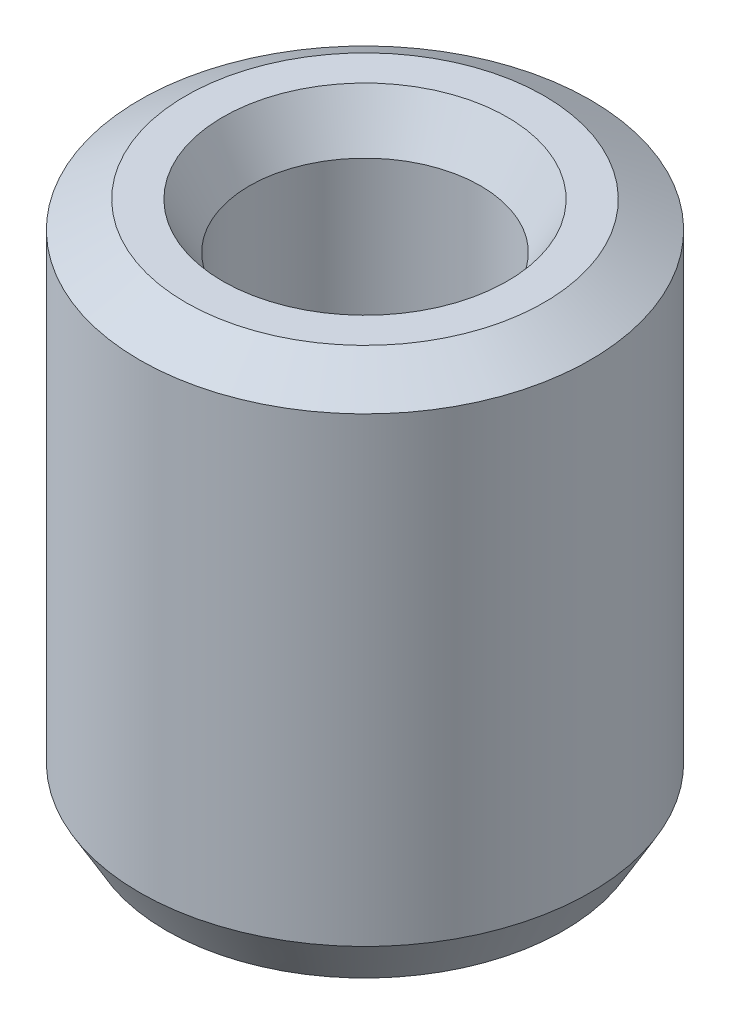
ISO-10303-21;
HEADER;
FILE_DESCRIPTION(('STEP AP214'),'2;1');
FILE_NAME('part.step','',(''),(''),'','','');
FILE_SCHEMA(('AUTOMOTIVE_DESIGN { 1 0 10303 214 1 1 1 1 }'));
ENDSEC;
DATA;
#1=APPLICATION_CONTEXT('core data for automotive mechanical design processes');
#2=APPLICATION_PROTOCOL_DEFINITION('international standard','automotive_design',2000,#1);
#3=PRODUCT_CONTEXT('',#1,'mechanical');
#4=PRODUCT('Part','Part','',(#3));
#5=PRODUCT_RELATED_PRODUCT_CATEGORY('part','',(#4));
#6=PRODUCT_DEFINITION_FORMATION('','',#4);
#7=PRODUCT_DEFINITION_CONTEXT('part definition',#1,'design');
#8=PRODUCT_DEFINITION('design','',#6,#7);
#9=PRODUCT_DEFINITION_SHAPE('','',#8);
#10=(LENGTH_UNIT() NAMED_UNIT(*) SI_UNIT(.MILLI.,.METRE.));
#11=(NAMED_UNIT(*) PLANE_ANGLE_UNIT() SI_UNIT($,.RADIAN.));
#12=(NAMED_UNIT(*) SI_UNIT($,.STERADIAN.) SOLID_ANGLE_UNIT());
#13=UNCERTAINTY_MEASURE_WITH_UNIT(LENGTH_MEASURE(1.E-05),#10,'distance_accuracy_value','');
#14=(GEOMETRIC_REPRESENTATION_CONTEXT(3) GLOBAL_UNCERTAINTY_ASSIGNED_CONTEXT((#13)) GLOBAL_UNIT_ASSIGNED_CONTEXT((#10,
#11,#12)) REPRESENTATION_CONTEXT('',''));
#15=CARTESIAN_POINT('',(0.,0.,0.));
#16=DIRECTION('',(0.,0.,1.));
#17=DIRECTION('',(1.,0.,0.));
#18=AXIS2_PLACEMENT_3D('',#15,#16,#17);
#19=CARTESIAN_POINT('',(0.,23.7034741113155,0.));
#20=DIRECTION('',(0.,-1.,0.));
#21=DIRECTION('',(0.,0.,-1.));
#22=AXIS2_PLACEMENT_3D('',#19,#20,#21);
#23=CYLINDRICAL_SURFACE('',#22,10.);
#24=CARTESIAN_POINT('',(0.,2.050494007033,0.));
#25=DIRECTION('',(0.,1.,0.));
#26=DIRECTION('',(0.,0.,1.));
#27=AXIS2_PLACEMENT_3D('',#24,#25,#26);
#28=CIRCLE('',#27,10.);
#29=CARTESIAN_POINT('',(0.,2.05049400703299,-10.));
#30=VERTEX_POINT('',#29);
#31=EDGE_CURVE('E10',#30,#30,#28,.T.);
#32=CARTESIAN_POINT('',(0.,22.5196208443834,0.));
#33=DIRECTION('',(0.,1.,0.));
#34=DIRECTION('',(0.,0.,1.));
#35=AXIS2_PLACEMENT_3D('',#32,#33,#34);
#36=CIRCLE('',#35,10.);
#37=CARTESIAN_POINT('',(0.,22.5196208443833,-10.));
#38=VERTEX_POINT('',#37);
#39=EDGE_CURVE('E50',#38,#38,#36,.F.);
#40=CARTESIAN_POINT('',(0.,2.05049400703299,-10.));
#41=CARTESIAN_POINT('',(0.,2.26371407825539,-10.));
#42=CARTESIAN_POINT('',(0.,2.47693414947779,-10.));
#43=CARTESIAN_POINT('',(0.,2.90337429192259,-10.));
#44=CARTESIAN_POINT('',(0.,3.11659436314499,-10.));
#45=CARTESIAN_POINT('',(0.,3.54303450558979,-10.));
#46=CARTESIAN_POINT('',(0.,3.75625457681219,-10.));
#47=CARTESIAN_POINT('',(0.,4.18269471925699,-10.));
#48=CARTESIAN_POINT('',(0.,4.39591479047939,-10.));
#49=CARTESIAN_POINT('',(0.,4.82235493292419,-10.));
#50=CARTESIAN_POINT('',(0.,5.03557500414659,-10.));
#51=CARTESIAN_POINT('',(0.,5.46201514659139,-10.));
#52=CARTESIAN_POINT('',(0.,5.67523521781379,-10.));
#53=CARTESIAN_POINT('',(0.,6.10167536025858,-10.));
#54=CARTESIAN_POINT('',(0.,6.31489543148098,-10.));
#55=CARTESIAN_POINT('',(0.,6.74133557392578,-10.));
#56=CARTESIAN_POINT('',(0.,6.95455564514818,-10.));
#57=CARTESIAN_POINT('',(0.,7.38099578759298,-10.));
#58=CARTESIAN_POINT('',(0.,7.59421585881538,-10.));
#59=CARTESIAN_POINT('',(0.,8.02065600126018,-10.));
#60=CARTESIAN_POINT('',(0.,8.23387607248258,-10.));
#61=CARTESIAN_POINT('',(0.,8.66031621492738,-10.));
#62=CARTESIAN_POINT('',(0.,8.87353628614978,-10.));
#63=CARTESIAN_POINT('',(0.,9.29997642859458,-10.));
#64=CARTESIAN_POINT('',(0.,9.51319649981698,-10.));
#65=CARTESIAN_POINT('',(0.,9.93963664226177,-10.));
#66=CARTESIAN_POINT('',(0.,10.1528567134842,-10.));
#67=CARTESIAN_POINT('',(0.,10.579296855929,-10.));
#68=CARTESIAN_POINT('',(0.,10.7925169271514,-10.));
#69=CARTESIAN_POINT('',(0.,11.2189570695962,-10.));
#70=CARTESIAN_POINT('',(0.,11.4321771408186,-10.));
#71=CARTESIAN_POINT('',(0.,11.8586172832634,-10.));
#72=CARTESIAN_POINT('',(0.,12.0718373544858,-10.));
#73=CARTESIAN_POINT('',(0.,12.4982774969306,-10.));
#74=CARTESIAN_POINT('',(0.,12.711497568153,-10.));
#75=CARTESIAN_POINT('',(0.,13.1379377105978,-10.));
#76=CARTESIAN_POINT('',(0.,13.3511577818202,-10.));
#77=CARTESIAN_POINT('',(0.,13.777597924265,-10.));
#78=CARTESIAN_POINT('',(0.,13.9908179954874,-10.));
#79=CARTESIAN_POINT('',(0.,14.4172581379322,-10.));
#80=CARTESIAN_POINT('',(0.,14.6304782091546,-10.));
#81=CARTESIAN_POINT('',(0.,15.0569183515994,-10.));
#82=CARTESIAN_POINT('',(0.,15.2701384228218,-10.));
#83=CARTESIAN_POINT('',(0.,15.6965785652666,-10.));
#84=CARTESIAN_POINT('',(0.,15.909798636489,-10.));
#85=CARTESIAN_POINT('',(0.,16.3362387789338,-10.));
#86=CARTESIAN_POINT('',(0.,16.5494588501562,-10.));
#87=CARTESIAN_POINT('',(0.,16.975898992601,-10.));
#88=CARTESIAN_POINT('',(0.,17.1891190638234,-10.));
#89=CARTESIAN_POINT('',(0.,17.6155592062682,-10.));
#90=CARTESIAN_POINT('',(0.,17.8287792774906,-10.));
#91=CARTESIAN_POINT('',(0.,18.2552194199354,-10.));
#92=CARTESIAN_POINT('',(0.,18.4684394911578,-10.));
#93=CARTESIAN_POINT('',(0.,18.8948796336026,-10.));
#94=CARTESIAN_POINT('',(0.,19.108099704825,-10.));
#95=CARTESIAN_POINT('',(0.,19.5345398472698,-10.));
#96=CARTESIAN_POINT('',(0.,19.7477599184922,-10.));
#97=CARTESIAN_POINT('',(0.,20.174200060937,-10.));
#98=CARTESIAN_POINT('',(0.,20.3874201321594,-10.));
#99=CARTESIAN_POINT('',(0.,20.8138602746042,-10.));
#100=CARTESIAN_POINT('',(0.,21.0270803458266,-10.));
#101=CARTESIAN_POINT('',(0.,21.4535204882714,-10.));
#102=CARTESIAN_POINT('',(0.,21.6667405594937,-10.));
#103=CARTESIAN_POINT('',(0.,22.0931807019386,-10.));
#104=CARTESIAN_POINT('',(0.,22.3064007731609,-10.));
#105=CARTESIAN_POINT('',(0.,22.5196208443833,-10.));
#106=B_SPLINE_CURVE_WITH_KNOTS('',3,(#40,#41,#42,#43,#44,#45,#46,#47,#48,#49,#50,#51,#52,#53,
#54,#55,#56,#57,#58,#59,#60,#61,#62,#63,#64,#65,#66,#67,#68,#69,#70,#71,#72,#73,#74,#75,#76,#77,
#78,#79,#80,#81,#82,#83,#84,#85,#86,#87,#88,#89,#90,#91,#92,#93,#94,#95,#96,#97,#98,#99,#100,
#101,#102,#103,#104,#105),.UNSPECIFIED.,.F.,.F.,(4,2,2,2,2,2,2,2,2,2,2,2,2,2,2,2,2,2,2,2,2,2,2,
2,2,2,2,2,2,2,2,2,4),(0.,0.639660213667199,1.2793204273344,1.9189806410016,2.55864085466879,
3.19830106833599,3.83796128200319,4.47762149567039,5.11728170933759,5.75694192300479,
6.39660213667199,7.03626235033918,7.67592256400638,8.31558277767358,8.95524299134078,
9.59490320500798,10.2345634186752,10.8742236323424,11.5138838460096,12.1535440596768,
12.793204273344,13.4328644870112,14.0725247006784,14.7121849143456,15.3518451280128,
15.99150534168,16.6311655553472,17.2708257690144,17.9104859826816,18.5501461963488,
19.189806410016,19.8294666236832,20.4691268373504),.UNSPECIFIED.);
#107=EDGE_CURVE('BSEAM39',#30,#38,#106,.T.);
#108=ORIENTED_EDGE('',*,*,#31,.T.);
#109=ORIENTED_EDGE('',*,*,#39,.T.);
#110=ORIENTED_EDGE('',*,*,#107,.T.);
#111=ORIENTED_EDGE('',*,*,#107,.F.);
#112=EDGE_LOOP('',(#108,#110,#109,#111));
#113=FACE_BOUND('',#112,.T.);
#114=ADVANCED_FACE('F39',(#113),#23,.T.);
#115=CARTESIAN_POINT('',(0.,23.7034741113155,0.));
#116=DIRECTION('',(0.,1.,0.));
#117=DIRECTION('',(0.,0.,1.));
#118=AXIS2_PLACEMENT_3D('',#115,#116,#117);
#119=PLANE('',#118);
#120=CARTESIAN_POINT('',(0.,23.7034741113155,0.));
#121=DIRECTION('',(0.,1.,0.));
#122=DIRECTION('',(0.,0.,1.));
#123=AXIS2_PLACEMENT_3D('',#120,#121,#122);
#124=CIRCLE('',#123,6.31220253744735);
#125=CARTESIAN_POINT('',(0.,23.7034741113155,6.31220253744735));
#126=VERTEX_POINT('',#125);
#127=EDGE_CURVE('E58',#126,#126,#124,.F.);
#128=ORIENTED_EDGE('',*,*,#127,.T.);
#129=EDGE_LOOP('',(#128));
#130=FACE_BOUND('',#129,.T.);
#131=CARTESIAN_POINT('',(0.,23.7034741113155,0.));
#132=DIRECTION('',(0.,1.,0.));
#133=DIRECTION('',(0.,0.,1.));
#134=AXIS2_PLACEMENT_3D('',#131,#132,#133);
#135=CIRCLE('',#134,7.94950599296707);
#136=CARTESIAN_POINT('',(0.,23.7034741113155,7.94950599296707));
#137=VERTEX_POINT('',#136);
#138=EDGE_CURVE('E61',#137,#137,#135,.T.);
#139=ORIENTED_EDGE('',*,*,#138,.T.);
#140=EDGE_LOOP('',(#139));
#141=FACE_BOUND('',#140,.T.);
#142=ADVANCED_FACE('F88',(#130,#141),#119,.T.);
#143=CARTESIAN_POINT('',(0.,0.,0.));
#144=DIRECTION('',(0.,1.,0.));
#145=DIRECTION('',(0.,0.,1.));
#146=AXIS2_PLACEMENT_3D('',#143,#144,#145);
#147=PLANE('',#146);
#148=CARTESIAN_POINT('',(0.,0.,0.));
#149=DIRECTION('',(0.,1.,0.));
#150=DIRECTION('',(0.,0.,1.));
#151=AXIS2_PLACEMENT_3D('',#148,#149,#150);
#152=CIRCLE('',#151,7.17884327754806);
#153=CARTESIAN_POINT('',(0.,0.,7.17884327754806));
#154=VERTEX_POINT('',#153);
#155=EDGE_CURVE('E51',#154,#154,#152,.T.);
#156=ORIENTED_EDGE('',*,*,#155,.T.);
#157=EDGE_LOOP('',(#156));
#158=FACE_BOUND('',#157,.T.);
#159=CARTESIAN_POINT('',(0.,0.,0.));
#160=DIRECTION('',(0.,1.,0.));
#161=DIRECTION('',(0.,0.,1.));
#162=AXIS2_PLACEMENT_3D('',#159,#160,#161);
#163=CIRCLE('',#162,8.81614673306778);
#164=CARTESIAN_POINT('',(0.,0.,8.81614673306778));
#165=VERTEX_POINT('',#164);
#166=EDGE_CURVE('E54',#165,#165,#163,.F.);
#167=ORIENTED_EDGE('',*,*,#166,.T.);
#168=EDGE_LOOP('',(#167));
#169=FACE_BOUND('',#168,.T.);
#170=ADVANCED_FACE('F83',(#158,#169),#147,.F.);
#171=CARTESIAN_POINT('',(0.,23.7034741113155,0.));
#172=DIRECTION('',(0.,-1.,0.));
#173=DIRECTION('',(0.,0.,-1.));
#174=AXIS2_PLACEMENT_3D('',#171,#172,#173);
#175=CYLINDRICAL_SURFACE('',#174,5.12834927051512);
#176=CARTESIAN_POINT('',(0.,21.6529801042825,0.));
#177=DIRECTION('',(0.,1.,0.));
#178=DIRECTION('',(0.,0.,1.));
#179=AXIS2_PLACEMENT_3D('',#176,#177,#178);
#180=CIRCLE('',#179,5.12834927051512);
#181=CARTESIAN_POINT('',(0.,21.6529801042825,-5.12834927051512));
#182=VERTEX_POINT('',#181);
#183=EDGE_CURVE('E67',#182,#182,#180,.T.);
#184=CARTESIAN_POINT('',(0.,1.18385326693219,0.));
#185=DIRECTION('',(0.,1.,0.));
#186=DIRECTION('',(0.,0.,1.));
#187=AXIS2_PLACEMENT_3D('',#184,#185,#186);
#188=CIRCLE('',#187,5.12834927051512);
#189=CARTESIAN_POINT('',(0.,1.18385326693219,-5.12834927051512));
#190=VERTEX_POINT('',#189);
#191=EDGE_CURVE('E69',#190,#190,#188,.F.);
#192=CARTESIAN_POINT('',(0.,21.6529801042825,-5.12834927051512));
#193=CARTESIAN_POINT('',(0.,21.4397600330601,-5.12834927051512));
#194=CARTESIAN_POINT('',(0.,21.2265399618377,-5.12834927051512));
#195=CARTESIAN_POINT('',(0.,20.8000998193929,-5.12834927051512));
#196=CARTESIAN_POINT('',(0.,20.5868797481705,-5.12834927051512));
#197=CARTESIAN_POINT('',(0.,20.1604396057257,-5.12834927051512));
#198=CARTESIAN_POINT('',(0.,19.9472195345033,-5.12834927051512));
#199=CARTESIAN_POINT('',(0.,19.5207793920585,-5.12834927051512));
#200=CARTESIAN_POINT('',(0.,19.3075593208361,-5.12834927051512));
#201=CARTESIAN_POINT('',(0.,18.8811191783913,-5.12834927051512));
#202=CARTESIAN_POINT('',(0.,18.6678991071689,-5.12834927051512));
#203=CARTESIAN_POINT('',(0.,18.2414589647241,-5.12834927051512));
#204=CARTESIAN_POINT('',(0.,18.0282388935017,-5.12834927051512));
#205=CARTESIAN_POINT('',(0.,17.6017987510569,-5.12834927051512));
#206=CARTESIAN_POINT('',(0.,17.3885786798345,-5.12834927051512));
#207=CARTESIAN_POINT('',(0.,16.9621385373897,-5.12834927051512));
#208=CARTESIAN_POINT('',(0.,16.7489184661673,-5.12834927051512));
#209=CARTESIAN_POINT('',(0.,16.3224783237225,-5.12834927051512));
#210=CARTESIAN_POINT('',(0.,16.1092582525002,-5.12834927051512));
#211=CARTESIAN_POINT('',(0.,15.6828181100554,-5.12834927051512));
#212=CARTESIAN_POINT('',(0.,15.469598038833,-5.12834927051512));
#213=CARTESIAN_POINT('',(0.,15.0431578963882,-5.12834927051512));
#214=CARTESIAN_POINT('',(0.,14.8299378251658,-5.12834927051512));
#215=CARTESIAN_POINT('',(0.,14.403497682721,-5.12834927051512));
#216=CARTESIAN_POINT('',(0.,14.1902776114986,-5.12834927051512));
#217=CARTESIAN_POINT('',(0.,13.7638374690538,-5.12834927051512));
#218=CARTESIAN_POINT('',(0.,13.5506173978314,-5.12834927051512));
#219=CARTESIAN_POINT('',(0.,13.1241772553866,-5.12834927051512));
#220=CARTESIAN_POINT('',(0.,12.9109571841642,-5.12834927051512));
#221=CARTESIAN_POINT('',(0.,12.4845170417194,-5.12834927051512));
#222=CARTESIAN_POINT('',(0.,12.271296970497,-5.12834927051512));
#223=CARTESIAN_POINT('',(0.,11.8448568280522,-5.12834927051512));
#224=CARTESIAN_POINT('',(0.,11.6316367568298,-5.12834927051512));
#225=CARTESIAN_POINT('',(0.,11.205196614385,-5.12834927051512));
#226=CARTESIAN_POINT('',(0.,10.9919765431626,-5.12834927051512));
#227=CARTESIAN_POINT('',(0.,10.5655364007178,-5.12834927051512));
#228=CARTESIAN_POINT('',(0.,10.3523163294954,-5.12834927051512));
#229=CARTESIAN_POINT('',(0.,9.92587618705057,-5.12834927051512));
#230=CARTESIAN_POINT('',(0.,9.71265611582817,-5.12834927051512));
#231=CARTESIAN_POINT('',(0.,9.28621597338337,-5.12834927051512));
#232=CARTESIAN_POINT('',(0.,9.07299590216097,-5.12834927051512));
#233=CARTESIAN_POINT('',(0.,8.64655575971617,-5.12834927051512));
#234=CARTESIAN_POINT('',(0.,8.43333568849377,-5.12834927051512));
#235=CARTESIAN_POINT('',(0.,8.00689554604897,-5.12834927051512));
#236=CARTESIAN_POINT('',(0.,7.79367547482657,-5.12834927051512));
#237=CARTESIAN_POINT('',(0.,7.36723533238177,-5.12834927051512));
#238=CARTESIAN_POINT('',(0.,7.15401526115938,-5.12834927051512));
#239=CARTESIAN_POINT('',(0.,6.72757511871458,-5.12834927051512));
#240=CARTESIAN_POINT('',(0.,6.51435504749218,-5.12834927051512));
#241=CARTESIAN_POINT('',(0.,6.08791490504738,-5.12834927051512));
#242=CARTESIAN_POINT('',(0.,5.87469483382498,-5.12834927051512));
#243=CARTESIAN_POINT('',(0.,5.44825469138018,-5.12834927051512));
#244=CARTESIAN_POINT('',(0.,5.23503462015778,-5.12834927051512));
#245=CARTESIAN_POINT('',(0.,4.80859447771298,-5.12834927051512));
#246=CARTESIAN_POINT('',(0.,4.59537440649058,-5.12834927051512));
#247=CARTESIAN_POINT('',(0.,4.16893426404578,-5.12834927051512));
#248=CARTESIAN_POINT('',(0.,3.95571419282338,-5.12834927051512));
#249=CARTESIAN_POINT('',(0.,3.52927405037858,-5.12834927051512));
#250=CARTESIAN_POINT('',(0.,3.31605397915618,-5.12834927051512));
#251=CARTESIAN_POINT('',(0.,2.88961383671138,-5.12834927051512));
#252=CARTESIAN_POINT('',(0.,2.67639376548899,-5.12834927051512));
#253=CARTESIAN_POINT('',(0.,2.24995362304419,-5.12834927051512));
#254=CARTESIAN_POINT('',(0.,2.03673355182179,-5.12834927051512));
#255=CARTESIAN_POINT('',(0.,1.61029340937699,-5.12834927051512));
#256=CARTESIAN_POINT('',(0.,1.39707333815459,-5.12834927051512));
#257=CARTESIAN_POINT('',(0.,1.18385326693219,-5.12834927051512));
#258=B_SPLINE_CURVE_WITH_KNOTS('',3,(#192,#193,#194,#195,#196,#197,#198,#199,#200,#201,#202,
#203,#204,#205,#206,#207,#208,#209,#210,#211,#212,#213,#214,#215,#216,#217,#218,#219,#220,#221,
#222,#223,#224,#225,#226,#227,#228,#229,#230,#231,#232,#233,#234,#235,#236,#237,#238,#239,#240,
#241,#242,#243,#244,#245,#246,#247,#248,#249,#250,#251,#252,#253,#254,#255,#256,#257),
.UNSPECIFIED.,.F.,.F.,(4,2,2,2,2,2,2,2,2,2,2,2,2,2,2,2,2,2,2,2,2,2,2,2,2,2,2,2,2,2,2,2,4),(0.,
0.639660213667199,1.2793204273344,1.9189806410016,2.55864085466879,3.19830106833599,
3.83796128200319,4.47762149567039,5.11728170933759,5.75694192300479,6.39660213667199,
7.03626235033918,7.67592256400638,8.31558277767358,8.95524299134078,9.59490320500798,
10.2345634186752,10.8742236323424,11.5138838460096,12.1535440596768,12.793204273344,
13.4328644870112,14.0725247006784,14.7121849143456,15.3518451280128,15.99150534168,
16.6311655553472,17.2708257690144,17.9104859826816,18.5501461963488,19.189806410016,
19.8294666236832,20.4691268373503),.UNSPECIFIED.);
#259=EDGE_CURVE('BSEAM71',#182,#190,#258,.T.);
#260=ORIENTED_EDGE('',*,*,#183,.T.);
#261=ORIENTED_EDGE('',*,*,#191,.T.);
#262=ORIENTED_EDGE('',*,*,#259,.T.);
#263=ORIENTED_EDGE('',*,*,#259,.F.);
#264=EDGE_LOOP('',(#260,#262,#261,#263));
#265=FACE_BOUND('',#264,.T.);
#266=ADVANCED_FACE('F71',(#265),#175,.F.);
#267=CARTESIAN_POINT('',(0.,21.6529801042825,0.));
#268=DIRECTION('',(0.,1.,0.));
#269=DIRECTION('',(0.,0.,1.));
#270=AXIS2_PLACEMENT_3D('',#267,#268,#269);
#271=CONICAL_SURFACE('',#270,5.12834927051512,0.523598775598303);
#272=ORIENTED_EDGE('',*,*,#127,.F.);
#273=EDGE_LOOP('',(#272));
#274=FACE_BOUND('',#273,.T.);
#275=ORIENTED_EDGE('',*,*,#183,.F.);
#276=EDGE_LOOP('',(#275));
#277=FACE_BOUND('',#276,.T.);
#278=ADVANCED_FACE('F77',(#274,#277),#271,.F.);
#279=CARTESIAN_POINT('',(0.,0.,0.));
#280=DIRECTION('',(0.,-1.,0.));
#281=DIRECTION('',(0.,0.,-1.));
#282=AXIS2_PLACEMENT_3D('',#279,#280,#281);
#283=CONICAL_SURFACE('',#282,7.17884327754806,1.04719755119659);
#284=ORIENTED_EDGE('',*,*,#191,.F.);
#285=EDGE_LOOP('',(#284));
#286=FACE_BOUND('',#285,.T.);
#287=ORIENTED_EDGE('',*,*,#155,.F.);
#288=EDGE_LOOP('',(#287));
#289=FACE_BOUND('',#288,.T.);
#290=ADVANCED_FACE('F73',(#286,#289),#283,.F.);
#291=CARTESIAN_POINT('',(0.,2.050494007033,0.));
#292=DIRECTION('',(0.,1.,0.));
#293=DIRECTION('',(0.,0.,1.));
#294=AXIS2_PLACEMENT_3D('',#291,#292,#293);
#295=CONICAL_SURFACE('',#294,10.,0.523598775598303);
#296=ORIENTED_EDGE('',*,*,#166,.F.);
#297=EDGE_LOOP('',(#296));
#298=FACE_BOUND('',#297,.T.);
#299=ORIENTED_EDGE('',*,*,#31,.F.);
#300=EDGE_LOOP('',(#299));
#301=FACE_BOUND('',#300,.T.);
#302=ADVANCED_FACE('F76',(#298,#301),#295,.T.);
#303=CARTESIAN_POINT('',(0.,23.7034741113155,0.));
#304=DIRECTION('',(0.,-1.,0.));
#305=DIRECTION('',(0.,0.,-1.));
#306=AXIS2_PLACEMENT_3D('',#303,#304,#305);
#307=CONICAL_SURFACE('',#306,7.94950599296707,1.0471975511966);
#308=ORIENTED_EDGE('',*,*,#39,.F.);
#309=EDGE_LOOP('',(#308));
#310=FACE_BOUND('',#309,.T.);
#311=ORIENTED_EDGE('',*,*,#138,.F.);
#312=EDGE_LOOP('',(#311));
#313=FACE_BOUND('',#312,.T.);
#314=ADVANCED_FACE('F45',(#310,#313),#307,.T.);
#315=CLOSED_SHELL('',(#114,#142,#170,#266,#278,#290,#302,#314));
#316=MANIFOLD_SOLID_BREP('B2',#315);
#317=ADVANCED_BREP_SHAPE_REPRESENTATION('',(#18,#316),#14);
#318=SHAPE_DEFINITION_REPRESENTATION(#9,#317);
ENDSEC;
END-ISO-10303-21;
